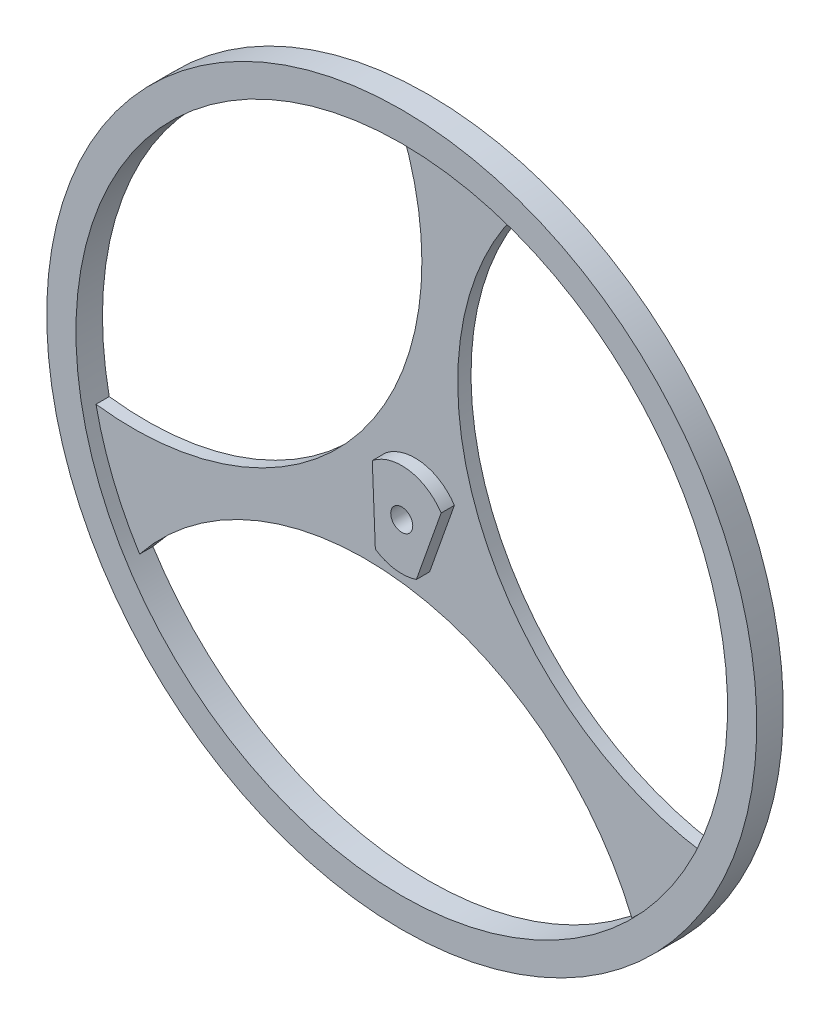
ISO-10303-21;
HEADER;
FILE_DESCRIPTION(('STEP AP214'),'2;1');
FILE_NAME('part.step','',(''),(''),'','','');
FILE_SCHEMA(('AUTOMOTIVE_DESIGN { 1 0 10303 214 1 1 1 1 }'));
ENDSEC;
DATA;
#1=APPLICATION_CONTEXT('core data for automotive mechanical design processes');
#2=APPLICATION_PROTOCOL_DEFINITION('international standard','automotive_design',2000,#1);
#3=PRODUCT_CONTEXT('',#1,'mechanical');
#4=PRODUCT('Part','Part','',(#3));
#5=PRODUCT_RELATED_PRODUCT_CATEGORY('part','',(#4));
#6=PRODUCT_DEFINITION_FORMATION('','',#4);
#7=PRODUCT_DEFINITION_CONTEXT('part definition',#1,'design');
#8=PRODUCT_DEFINITION('design','',#6,#7);
#9=PRODUCT_DEFINITION_SHAPE('','',#8);
#10=(LENGTH_UNIT() NAMED_UNIT(*) SI_UNIT(.MILLI.,.METRE.));
#11=(NAMED_UNIT(*) PLANE_ANGLE_UNIT() SI_UNIT($,.RADIAN.));
#12=(NAMED_UNIT(*) SI_UNIT($,.STERADIAN.) SOLID_ANGLE_UNIT());
#13=UNCERTAINTY_MEASURE_WITH_UNIT(LENGTH_MEASURE(1.E-05),#10,'distance_accuracy_value','');
#14=(GEOMETRIC_REPRESENTATION_CONTEXT(3) GLOBAL_UNCERTAINTY_ASSIGNED_CONTEXT((#13)) GLOBAL_UNIT_ASSIGNED_CONTEXT((#10,
#11,#12)) REPRESENTATION_CONTEXT('',''));
#15=CARTESIAN_POINT('',(0.,0.,0.));
#16=DIRECTION('',(0.,0.,1.));
#17=DIRECTION('',(1.,0.,0.));
#18=AXIS2_PLACEMENT_3D('',#15,#16,#17);
#19=CARTESIAN_POINT('',(40.568691890745,-17.9868409757702,11.1278965783977));
#20=DIRECTION('',(0.,0.,1.));
#21=DIRECTION('',(1.,0.,0.));
#22=AXIS2_PLACEMENT_3D('',#19,#20,#21);
#23=PLANE('',#22);
#24=CARTESIAN_POINT('',(41.118624509741,-17.1137621192302,11.1278965783977));
#25=DIRECTION('',(0.,0.,1.));
#26=DIRECTION('',(0.,-1.,0.));
#27=AXIS2_PLACEMENT_3D('',#24,#25,#26);
#28=CIRCLE('',#27,0.202875616580001);
#29=CARTESIAN_POINT('',(41.118624509741,-17.3166377358102,11.1278965783977));
#30=VERTEX_POINT('',#29);
#31=EDGE_CURVE('E38',#30,#30,#28,.T.);
#32=ORIENTED_EDGE('',*,*,#31,.F.);
#33=EDGE_LOOP('',(#32));
#34=FACE_BOUND('',#33,.T.);
#35=DIRECTION('',(-0.0404772931340448,0.999180458546173,0.));
#36=VECTOR('',#35,1.);
#37=CARTESIAN_POINT('',(40.604319306745,-17.1345968767522,11.1278965783977));
#38=LINE('',#37,#36);
#39=CARTESIAN_POINT('',(40.6323438759698,-17.8263823143914,11.1278965783977));
#40=VERTEX_POINT('',#39);
#41=CARTESIAN_POINT('',(40.5762947374488,-16.442811438913,11.1278965783977));
#42=VERTEX_POINT('',#41);
#43=EDGE_CURVE('E108',#40,#42,#38,.T.);
#44=ORIENTED_EDGE('',*,*,#43,.F.);
#45=CARTESIAN_POINT('',(41.118624509741,-17.1137621192302,11.1278965783977));
#46=DIRECTION('',(0.,0.,1.));
#47=DIRECTION('',(1.,0.,0.));
#48=AXIS2_PLACEMENT_3D('',#45,#46,#47);
#49=CIRCLE('',#48,0.86272614272);
#50=CARTESIAN_POINT('',(41.3877659036905,-17.933432362313,11.1278965783977));
#51=VERTEX_POINT('',#50);
#52=EDGE_CURVE('E127',#40,#51,#49,.T.);
#53=ORIENTED_EDGE('',*,*,#52,.T.);
#54=DIRECTION('',(-0.333619449133173,-0.942707835524919,0.));
#55=VECTOR('',#54,1.);
#56=CARTESIAN_POINT('',(41.615600883123,-17.2896394990042,11.1278965783977));
#57=LINE('',#56,#55);
#58=CARTESIAN_POINT('',(41.8434358627376,-16.6458466354662,11.1278965783977));
#59=VERTEX_POINT('',#58);
#60=EDGE_CURVE('E125',#59,#51,#57,.T.);
#61=ORIENTED_EDGE('',*,*,#60,.F.);
#62=CARTESIAN_POINT('',(41.118624509741,-17.1137621192302,11.1278965783977));
#63=DIRECTION('',(0.,0.,1.));
#64=DIRECTION('',(1.,0.,0.));
#65=AXIS2_PLACEMENT_3D('',#62,#63,#64);
#66=CIRCLE('',#65,0.86272614272);
#67=EDGE_CURVE('E102',#59,#42,#66,.T.);
#68=ORIENTED_EDGE('',*,*,#67,.T.);
#69=EDGE_LOOP('',(#44,#53,#61,#68));
#70=FACE_BOUND('',#69,.T.);
#71=ADVANCED_FACE('F34',(#34,#70),#23,.T.);
#72=CARTESIAN_POINT('',(41.118624509741,-17.1137621192302,10.6398965783977));
#73=DIRECTION('',(0.,0.,1.));
#74=DIRECTION('',(0.,-1.,0.));
#75=AXIS2_PLACEMENT_3D('',#72,#73,#74);
#76=CYLINDRICAL_SURFACE('',#75,6.53628422196);
#77=CARTESIAN_POINT('',(41.118624509741,-17.1137621192302,11.1278965783977));
#78=DIRECTION('',(0.,0.,1.));
#79=DIRECTION('',(0.,-1.,0.));
#80=AXIS2_PLACEMENT_3D('',#77,#78,#79);
#81=CIRCLE('',#80,6.53628422196);
#82=CARTESIAN_POINT('',(41.118624509741,-23.6500463411902,11.1278965783977));
#83=VERTEX_POINT('',#82);
#84=EDGE_CURVE('E130',#83,#83,#81,.T.);
#85=ORIENTED_EDGE('',*,*,#84,.F.);
#86=EDGE_LOOP('',(#85));
#87=FACE_BOUND('',#86,.T.);
#88=CARTESIAN_POINT('',(41.118624509741,-17.1137621192302,10.6398965783977));
#89=DIRECTION('',(0.,0.,1.));
#90=DIRECTION('',(0.,-1.,0.));
#91=AXIS2_PLACEMENT_3D('',#88,#89,#90);
#92=CIRCLE('',#91,6.53628422196);
#93=CARTESIAN_POINT('',(41.118624509741,-23.6500463411902,10.6398965783977));
#94=VERTEX_POINT('',#93);
#95=EDGE_CURVE('E134',#94,#94,#92,.T.);
#96=ORIENTED_EDGE('',*,*,#95,.T.);
#97=EDGE_LOOP('',(#96));
#98=FACE_BOUND('',#97,.T.);
#99=ADVANCED_FACE('F235',(#87,#98),#76,.T.);
#100=CARTESIAN_POINT('',(41.118624509741,-17.1137621192302,10.6398965783977));
#101=DIRECTION('',(0.,0.,1.));
#102=DIRECTION('',(0.,-1.,0.));
#103=AXIS2_PLACEMENT_3D('',#100,#101,#102);
#104=CYLINDRICAL_SURFACE('',#103,0.202875616580001);
#105=ORIENTED_EDGE('',*,*,#31,.T.);
#106=EDGE_LOOP('',(#105));
#107=FACE_BOUND('',#106,.T.);
#108=CARTESIAN_POINT('',(41.118624509741,-17.1137621192302,10.6398965783977));
#109=DIRECTION('',(0.,0.,1.));
#110=DIRECTION('',(0.,-1.,0.));
#111=AXIS2_PLACEMENT_3D('',#108,#109,#110);
#112=CIRCLE('',#111,0.202875616580001);
#113=CARTESIAN_POINT('',(41.118624509741,-17.3166377358102,10.6398965783977));
#114=VERTEX_POINT('',#113);
#115=EDGE_CURVE('E141',#114,#114,#112,.F.);
#116=ORIENTED_EDGE('',*,*,#115,.T.);
#117=EDGE_LOOP('',(#116));
#118=FACE_BOUND('',#117,.T.);
#119=ADVANCED_FACE('F237',(#107,#118),#104,.F.);
#120=CARTESIAN_POINT('',(40.204920710209,-23.6286757285582,10.6398965783977));
#121=DIRECTION('',(0.,0.,1.));
#122=DIRECTION('',(0.,-1.,0.));
#123=AXIS2_PLACEMENT_3D('',#120,#121,#122);
#124=CYLINDRICAL_SURFACE('',#123,5.312006957348);
#125=CARTESIAN_POINT('',(40.204920710209,-23.6286757285582,10.8838965783977));
#126=DIRECTION('',(0.,0.,1.));
#127=DIRECTION('',(0.,-1.,0.));
#128=AXIS2_PLACEMENT_3D('',#125,#126,#127);
#129=CIRCLE('',#128,5.312006957348);
#130=CARTESIAN_POINT('',(36.0491641064278,-20.3200347741718,10.8838965783977));
#131=VERTEX_POINT('',#130);
#132=CARTESIAN_POINT('',(45.1105059132462,-21.5908701120541,10.8838965783977));
#133=VERTEX_POINT('',#132);
#134=EDGE_CURVE('E149',#131,#133,#129,.F.);
#135=ORIENTED_EDGE('',*,*,#134,.F.);
#136=DIRECTION('',(0.,0.,1.));
#137=VECTOR('',#136,1.);
#138=CARTESIAN_POINT('',(36.0491641071243,-20.320034773297,10.7618965783977));
#139=LINE('',#138,#137);
#140=CARTESIAN_POINT('',(36.0491641064278,-20.3200347741718,10.6398965783977));
#141=VERTEX_POINT('',#140);
#142=EDGE_CURVE('E183',#131,#141,#139,.F.);
#143=ORIENTED_EDGE('',*,*,#142,.T.);
#144=CARTESIAN_POINT('',(40.204920710209,-23.6286757285582,10.6398965783977));
#145=DIRECTION('',(0.,0.,1.));
#146=DIRECTION('',(0.,-1.,0.));
#147=AXIS2_PLACEMENT_3D('',#144,#145,#146);
#148=CIRCLE('',#147,5.312006957348);
#149=CARTESIAN_POINT('',(45.1105059132462,-21.5908701120541,10.6398965783977));
#150=VERTEX_POINT('',#149);
#151=EDGE_CURVE('E144',#141,#150,#148,.F.);
#152=ORIENTED_EDGE('',*,*,#151,.T.);
#153=DIRECTION('',(0.,0.,-1.));
#154=VECTOR('',#153,1.);
#155=CARTESIAN_POINT('',(45.1105059128333,-21.5908701110599,10.7618965783977));
#156=LINE('',#155,#154);
#157=EDGE_CURVE('E186',#150,#133,#156,.F.);
#158=ORIENTED_EDGE('',*,*,#157,.T.);
#159=EDGE_LOOP('',(#135,#143,#152,#158));
#160=FACE_BOUND('',#159,.T.);
#161=ADVANCED_FACE('F244',(#160),#124,.F.);
#162=CARTESIAN_POINT('',(47.217557098801,-14.6475960167302,10.6398965783977));
#163=DIRECTION('',(0.,0.,1.));
#164=DIRECTION('',(0.,-1.,0.));
#165=AXIS2_PLACEMENT_3D('',#162,#163,#164);
#166=CYLINDRICAL_SURFACE('',#165,5.31200695734799);
#167=DIRECTION('',(0.,0.,1.));
#168=VECTOR('',#167,1.);
#169=CARTESIAN_POINT('',(42.9999730633118,-11.4181374167734,10.8838965783977));
#170=LINE('',#169,#168);
#171=CARTESIAN_POINT('',(42.9999730647469,-11.4181374172475,10.8838965783977));
#172=VERTEX_POINT('',#171);
#173=CARTESIAN_POINT('',(42.9999730647469,-11.4181374172475,10.6398965783977));
#174=VERTEX_POINT('',#173);
#175=EDGE_CURVE('E138',#172,#174,#170,.F.);
#176=ORIENTED_EDGE('',*,*,#175,.F.);
#177=CARTESIAN_POINT('',(47.217557098801,-14.6475960167302,10.8838965783977));
#178=DIRECTION('',(0.,0.,1.));
#179=DIRECTION('',(0.,-1.,0.));
#180=AXIS2_PLACEMENT_3D('',#177,#178,#179);
#181=CIRCLE('',#180,5.31200695734799);
#182=CARTESIAN_POINT('',(46.4300682836563,-19.9009072849624,10.8838965783977));
#183=VERTEX_POINT('',#182);
#184=EDGE_CURVE('E152',#183,#172,#181,.F.);
#185=ORIENTED_EDGE('',*,*,#184,.F.);
#186=DIRECTION('',(0.,0.,1.));
#187=VECTOR('',#186,1.);
#188=CARTESIAN_POINT('',(46.4300682842733,-19.9009072850549,10.7618965783977));
#189=LINE('',#188,#187);
#190=CARTESIAN_POINT('',(46.4300682836563,-19.9009072849624,10.6398965783977));
#191=VERTEX_POINT('',#190);
#192=EDGE_CURVE('E185',#183,#191,#189,.F.);
#193=ORIENTED_EDGE('',*,*,#192,.T.);
#194=CARTESIAN_POINT('',(47.217557098801,-14.6475960167302,10.6398965783977));
#195=DIRECTION('',(0.,0.,1.));
#196=DIRECTION('',(0.,-1.,0.));
#197=AXIS2_PLACEMENT_3D('',#194,#195,#196);
#198=CIRCLE('',#197,5.31200695734799);
#199=EDGE_CURVE('E137',#191,#174,#198,.F.);
#200=ORIENTED_EDGE('',*,*,#199,.T.);
#201=EDGE_LOOP('',(#176,#185,#193,#200));
#202=FACE_BOUND('',#201,.T.);
#203=ADVANCED_FACE('F262',(#202),#166,.F.);
#204=CARTESIAN_POINT('',(35.933395720701,-13.0650146126462,10.6398965783977));
#205=DIRECTION('',(0.,0.,1.));
#206=DIRECTION('',(0.,-1.,0.));
#207=AXIS2_PLACEMENT_3D('',#204,#205,#206);
#208=CYLINDRICAL_SURFACE('',#207,5.312006957348);
#209=DIRECTION('',(0.,0.,-1.));
#210=VECTOR('',#209,1.);
#211=CARTESIAN_POINT('',(35.2453945479748,-18.3322788267559,10.7618965783977));
#212=LINE('',#211,#210);
#213=CARTESIAN_POINT('',(35.2453945488082,-18.3322788268648,10.6398965783977));
#214=VERTEX_POINT('',#213);
#215=CARTESIAN_POINT('',(35.2453945488082,-18.3322788268648,10.8838965783977));
#216=VERTEX_POINT('',#215);
#217=EDGE_CURVE('E53',#214,#216,#212,.F.);
#218=ORIENTED_EDGE('',*,*,#217,.T.);
#219=CARTESIAN_POINT('',(35.933395720701,-13.0650146126462,10.8838965783977));
#220=DIRECTION('',(0.,0.,1.));
#221=DIRECTION('',(0.,-1.,0.));
#222=AXIS2_PLACEMENT_3D('',#219,#220,#221);
#223=CIRCLE('',#222,5.312006957348);
#224=CARTESIAN_POINT('',(40.8766411419281,-11.1203442979065,10.8838965783977));
#225=VERTEX_POINT('',#224);
#226=EDGE_CURVE('E157',#225,#216,#223,.F.);
#227=ORIENTED_EDGE('',*,*,#226,.F.);
#228=DIRECTION('',(0.,0.,-1.));
#229=VECTOR('',#228,1.);
#230=CARTESIAN_POINT('',(40.8766411431824,-11.1203442978559,10.8838965783977));
#231=LINE('',#230,#229);
#232=CARTESIAN_POINT('',(40.8766411419281,-11.1203442979065,10.6398965783977));
#233=VERTEX_POINT('',#232);
#234=EDGE_CURVE('E133',#233,#225,#231,.F.);
#235=ORIENTED_EDGE('',*,*,#234,.F.);
#236=CARTESIAN_POINT('',(35.933395720701,-13.0650146126462,10.6398965783977));
#237=DIRECTION('',(0.,0.,1.));
#238=DIRECTION('',(0.,-1.,0.));
#239=AXIS2_PLACEMENT_3D('',#236,#237,#238);
#240=CIRCLE('',#239,5.312006957348);
#241=EDGE_CURVE('E147',#233,#214,#240,.F.);
#242=ORIENTED_EDGE('',*,*,#241,.T.);
#243=EDGE_LOOP('',(#218,#227,#235,#242));
#244=FACE_BOUND('',#243,.T.);
#245=ADVANCED_FACE('F221',(#244),#208,.F.);
#246=CARTESIAN_POINT('',(40.576294737497,-16.4428114389502,10.8838965783977));
#247=DIRECTION('',(-0.999180458546173,-0.0404772931340448,0.));
#248=DIRECTION('',(0.0404772931340448,-0.999180458546173,0.));
#249=AXIS2_PLACEMENT_3D('',#246,#247,#248);
#250=PLANE('',#249);
#251=DIRECTION('',(0.,0.,1.));
#252=VECTOR('',#251,1.);
#253=CARTESIAN_POINT('',(40.5762947374036,-16.4428114389495,11.0058965783977));
#254=LINE('',#253,#252);
#255=CARTESIAN_POINT('',(40.5762947384304,-16.4428114381196,10.8838965783977));
#256=VERTEX_POINT('',#255);
#257=EDGE_CURVE('E111',#42,#256,#254,.F.);
#258=ORIENTED_EDGE('',*,*,#257,.T.);
#259=DIRECTION('',(-0.040477293538461,0.99918045852979,0.));
#260=VECTOR('',#259,1.);
#261=CARTESIAN_POINT('',(40.6323438785983,-17.8263823149731,10.8838965783977));
#262=LINE('',#261,#260);
#263=CARTESIAN_POINT('',(40.6323438773008,-17.8263823152996,10.8838965783977));
#264=VERTEX_POINT('',#263);
#265=EDGE_CURVE('E159',#264,#256,#262,.T.);
#266=ORIENTED_EDGE('',*,*,#265,.F.);
#267=DIRECTION('',(0.,0.,-1.));
#268=VECTOR('',#267,1.);
#269=CARTESIAN_POINT('',(40.6323438759528,-17.8263823143798,11.0058965783977));
#270=LINE('',#269,#268);
#271=EDGE_CURVE('E114',#264,#40,#270,.F.);
#272=ORIENTED_EDGE('',*,*,#271,.T.);
#273=ORIENTED_EDGE('',*,*,#43,.T.);
#274=EDGE_LOOP('',(#258,#266,#272,#273));
#275=FACE_BOUND('',#274,.T.);
#276=ADVANCED_FACE('F109',(#275),#250,.T.);
#277=CARTESIAN_POINT('',(41.118624509741,-17.1137621192302,10.8838965783977));
#278=DIRECTION('',(0.,0.,1.));
#279=DIRECTION('',(1.,0.,0.));
#280=AXIS2_PLACEMENT_3D('',#277,#278,#279);
#281=CYLINDRICAL_SURFACE('',#280,0.86272614272);
#282=ORIENTED_EDGE('',*,*,#67,.F.);
#283=DIRECTION('',(0.,0.,1.));
#284=VECTOR('',#283,1.);
#285=CARTESIAN_POINT('',(41.843435862749,-16.6458466354342,11.0058965783977));
#286=LINE('',#285,#284);
#287=CARTESIAN_POINT('',(41.8434358628824,-16.6458466356904,10.8838965783977));
#288=VERTEX_POINT('',#287);
#289=EDGE_CURVE('E122',#288,#59,#286,.T.);
#290=ORIENTED_EDGE('',*,*,#289,.F.);
#291=CARTESIAN_POINT('',(41.118624509741,-17.1137621192302,10.8838965783977));
#292=DIRECTION('',(0.,0.,1.));
#293=DIRECTION('',(1.,0.,0.));
#294=AXIS2_PLACEMENT_3D('',#291,#292,#293);
#295=CIRCLE('',#294,0.86272614272);
#296=EDGE_CURVE('E121',#256,#288,#295,.F.);
#297=ORIENTED_EDGE('',*,*,#296,.F.);
#298=ORIENTED_EDGE('',*,*,#257,.F.);
#299=EDGE_LOOP('',(#282,#290,#297,#298));
#300=FACE_BOUND('',#299,.T.);
#301=ADVANCED_FACE('F119',(#300),#281,.T.);
#302=CARTESIAN_POINT('',(41.387765903497,-17.9334323625742,10.8838965783977));
#303=DIRECTION('',(0.942707835524919,-0.333619449133173,0.));
#304=DIRECTION('',(0.333619449133173,0.942707835524919,0.));
#305=AXIS2_PLACEMENT_3D('',#302,#303,#304);
#306=PLANE('',#305);
#307=DIRECTION('',(0.,0.,1.));
#308=VECTOR('',#307,1.);
#309=CARTESIAN_POINT('',(41.3877659038048,-17.9334323622754,11.0058965783977));
#310=LINE('',#309,#308);
#311=CARTESIAN_POINT('',(41.3877659048788,-17.9334323619228,10.8838965783977));
#312=VERTEX_POINT('',#311);
#313=EDGE_CURVE('E129',#51,#312,#310,.F.);
#314=ORIENTED_EDGE('',*,*,#313,.T.);
#315=DIRECTION('',(-0.333619448058076,-0.942707835905391,0.));
#316=VECTOR('',#315,1.);
#317=CARTESIAN_POINT('',(41.843435863758,-16.6458466338494,10.8838965783977));
#318=LINE('',#317,#316);
#319=EDGE_CURVE('E163',#288,#312,#318,.T.);
#320=ORIENTED_EDGE('',*,*,#319,.F.);
#321=ORIENTED_EDGE('',*,*,#289,.T.);
#322=ORIENTED_EDGE('',*,*,#60,.T.);
#323=EDGE_LOOP('',(#314,#320,#321,#322));
#324=FACE_BOUND('',#323,.T.);
#325=ADVANCED_FACE('F201',(#324),#306,.T.);
#326=CARTESIAN_POINT('',(41.118624509741,-17.1137621192302,10.8838965783977));
#327=DIRECTION('',(0.,0.,1.));
#328=DIRECTION('',(1.,0.,0.));
#329=AXIS2_PLACEMENT_3D('',#326,#327,#328);
#330=CYLINDRICAL_SURFACE('',#329,0.86272614272);
#331=ORIENTED_EDGE('',*,*,#52,.F.);
#332=ORIENTED_EDGE('',*,*,#271,.F.);
#333=CARTESIAN_POINT('',(41.118624509741,-17.1137621192302,10.8838965783977));
#334=DIRECTION('',(0.,0.,1.));
#335=DIRECTION('',(1.,0.,0.));
#336=AXIS2_PLACEMENT_3D('',#333,#334,#335);
#337=CIRCLE('',#336,0.86272614272);
#338=EDGE_CURVE('E166',#312,#264,#337,.F.);
#339=ORIENTED_EDGE('',*,*,#338,.F.);
#340=ORIENTED_EDGE('',*,*,#313,.F.);
#341=EDGE_LOOP('',(#331,#332,#339,#340));
#342=FACE_BOUND('',#341,.T.);
#343=ADVANCED_FACE('F205',(#342),#330,.T.);
#344=CARTESIAN_POINT('',(34.503904877381,-23.7284817518342,11.1278965783977));
#345=DIRECTION('',(0.,0.,1.));
#346=DIRECTION('',(1.,0.,0.));
#347=AXIS2_PLACEMENT_3D('',#344,#345,#346);
#348=PLANE('',#347);
#349=CARTESIAN_POINT('',(41.118624509741,-17.1137621192302,11.1278965783977));
#350=DIRECTION('',(0.,0.,1.));
#351=DIRECTION('',(0.,-1.,0.));
#352=AXIS2_PLACEMENT_3D('',#349,#350,#351);
#353=CIRCLE('',#352,5.99830085368);
#354=CARTESIAN_POINT('',(41.118624509741,-23.1120629729102,11.1278965783977));
#355=VERTEX_POINT('',#354);
#356=EDGE_CURVE('E171',#355,#355,#353,.T.);
#357=ORIENTED_EDGE('',*,*,#356,.F.);
#358=EDGE_LOOP('',(#357));
#359=FACE_BOUND('',#358,.T.);
#360=ORIENTED_EDGE('',*,*,#84,.T.);
#361=EDGE_LOOP('',(#360));
#362=FACE_BOUND('',#361,.T.);
#363=ADVANCED_FACE('F225',(#359,#362),#348,.T.);
#364=CARTESIAN_POINT('',(34.503904877381,-23.7284817518342,10.6398965783977));
#365=DIRECTION('',(0.,0.,1.));
#366=DIRECTION('',(1.,0.,0.));
#367=AXIS2_PLACEMENT_3D('',#364,#365,#366);
#368=PLANE('',#367);
#369=ORIENTED_EDGE('',*,*,#241,.F.);
#370=CARTESIAN_POINT('',(41.118624509741,-17.1137621192302,10.6398965783977));
#371=DIRECTION('',(0.,0.,1.));
#372=DIRECTION('',(0.,-1.,0.));
#373=AXIS2_PLACEMENT_3D('',#370,#371,#372);
#374=CIRCLE('',#373,5.99830085368);
#375=EDGE_CURVE('E169',#214,#233,#374,.F.);
#376=ORIENTED_EDGE('',*,*,#375,.F.);
#377=EDGE_LOOP('',(#369,#376));
#378=FACE_BOUND('',#377,.T.);
#379=ORIENTED_EDGE('',*,*,#151,.F.);
#380=CARTESIAN_POINT('',(41.118624509741,-17.1137621192302,10.6398965783977));
#381=DIRECTION('',(0.,0.,1.));
#382=DIRECTION('',(0.,-1.,0.));
#383=AXIS2_PLACEMENT_3D('',#380,#381,#382);
#384=CIRCLE('',#383,5.99830085368);
#385=EDGE_CURVE('E44',#150,#141,#384,.F.);
#386=ORIENTED_EDGE('',*,*,#385,.F.);
#387=EDGE_LOOP('',(#379,#386));
#388=FACE_BOUND('',#387,.T.);
#389=ORIENTED_EDGE('',*,*,#115,.F.);
#390=EDGE_LOOP('',(#389));
#391=FACE_BOUND('',#390,.T.);
#392=CARTESIAN_POINT('',(41.118624509741,-17.1137621192302,10.6398965783977));
#393=DIRECTION('',(0.,0.,1.));
#394=DIRECTION('',(0.,-1.,0.));
#395=AXIS2_PLACEMENT_3D('',#392,#393,#394);
#396=CIRCLE('',#395,5.99830085368);
#397=EDGE_CURVE('E174',#174,#191,#396,.F.);
#398=ORIENTED_EDGE('',*,*,#397,.F.);
#399=ORIENTED_EDGE('',*,*,#199,.F.);
#400=EDGE_LOOP('',(#398,#399));
#401=FACE_BOUND('',#400,.T.);
#402=ORIENTED_EDGE('',*,*,#95,.F.);
#403=EDGE_LOOP('',(#402));
#404=FACE_BOUND('',#403,.T.);
#405=ADVANCED_FACE('F211',(#378,#388,#391,#401,#404),#368,.F.);
#406=CARTESIAN_POINT('',(35.178286507297,-21.6537225660862,10.8838965783977));
#407=DIRECTION('',(0.,0.,1.));
#408=DIRECTION('',(1.,0.,0.));
#409=AXIS2_PLACEMENT_3D('',#406,#407,#408);
#410=PLANE('',#409);
#411=ORIENTED_EDGE('',*,*,#319,.T.);
#412=ORIENTED_EDGE('',*,*,#338,.T.);
#413=ORIENTED_EDGE('',*,*,#265,.T.);
#414=ORIENTED_EDGE('',*,*,#296,.T.);
#415=EDGE_LOOP('',(#411,#412,#413,#414));
#416=FACE_BOUND('',#415,.T.);
#417=CARTESIAN_POINT('',(41.118624509741,-17.1137621192302,10.8838965783977));
#418=DIRECTION('',(0.,0.,1.));
#419=DIRECTION('',(0.,-1.,0.));
#420=AXIS2_PLACEMENT_3D('',#417,#418,#419);
#421=CIRCLE('',#420,5.99830085368);
#422=EDGE_CURVE('E154',#172,#225,#421,.T.);
#423=ORIENTED_EDGE('',*,*,#422,.T.);
#424=ORIENTED_EDGE('',*,*,#226,.T.);
#425=CARTESIAN_POINT('',(41.118624509741,-17.1137621192302,10.8838965783977));
#426=DIRECTION('',(0.,0.,1.));
#427=DIRECTION('',(0.,-1.,0.));
#428=AXIS2_PLACEMENT_3D('',#425,#426,#427);
#429=CIRCLE('',#428,5.99830085368);
#430=EDGE_CURVE('E11',#131,#216,#429,.F.);
#431=ORIENTED_EDGE('',*,*,#430,.F.);
#432=ORIENTED_EDGE('',*,*,#134,.T.);
#433=CARTESIAN_POINT('',(41.118624509741,-17.1137621192302,10.8838965783977));
#434=DIRECTION('',(0.,0.,1.));
#435=DIRECTION('',(0.,-1.,0.));
#436=AXIS2_PLACEMENT_3D('',#433,#434,#435);
#437=CIRCLE('',#436,5.99830085368);
#438=EDGE_CURVE('E177',#183,#133,#437,.F.);
#439=ORIENTED_EDGE('',*,*,#438,.F.);
#440=ORIENTED_EDGE('',*,*,#184,.T.);
#441=EDGE_LOOP('',(#423,#424,#431,#432,#439,#440));
#442=FACE_BOUND('',#441,.T.);
#443=ADVANCED_FACE('F36',(#416,#442),#410,.T.);
#444=CARTESIAN_POINT('',(41.118624509741,-17.1137621192302,10.6398965783977));
#445=DIRECTION('',(0.,0.,1.));
#446=DIRECTION('',(0.,-1.,0.));
#447=AXIS2_PLACEMENT_3D('',#444,#445,#446);
#448=CYLINDRICAL_SURFACE('',#447,5.99830085368);
#449=ORIENTED_EDGE('',*,*,#356,.T.);
#450=EDGE_LOOP('',(#449));
#451=FACE_BOUND('',#450,.T.);
#452=ORIENTED_EDGE('',*,*,#430,.T.);
#453=ORIENTED_EDGE('',*,*,#217,.F.);
#454=ORIENTED_EDGE('',*,*,#375,.T.);
#455=ORIENTED_EDGE('',*,*,#234,.T.);
#456=ORIENTED_EDGE('',*,*,#422,.F.);
#457=ORIENTED_EDGE('',*,*,#175,.T.);
#458=ORIENTED_EDGE('',*,*,#397,.T.);
#459=ORIENTED_EDGE('',*,*,#192,.F.);
#460=ORIENTED_EDGE('',*,*,#438,.T.);
#461=ORIENTED_EDGE('',*,*,#157,.F.);
#462=ORIENTED_EDGE('',*,*,#385,.T.);
#463=ORIENTED_EDGE('',*,*,#142,.F.);
#464=EDGE_LOOP('',(#452,#453,#454,#455,#456,#457,#458,#459,#460,#461,#462,#463));
#465=FACE_BOUND('',#464,.T.);
#466=ADVANCED_FACE('F210',(#451,#465),#448,.F.);
#467=CLOSED_SHELL('',(#71,#99,#119,#161,#203,#245,#276,#301,#325,#343,#363,#405,#443,#466));
#468=MANIFOLD_SOLID_BREP('B2',#467);
#469=ADVANCED_BREP_SHAPE_REPRESENTATION('',(#18,#468),#14);
#470=SHAPE_DEFINITION_REPRESENTATION(#9,#469);
ENDSEC;
END-ISO-10303-21;
